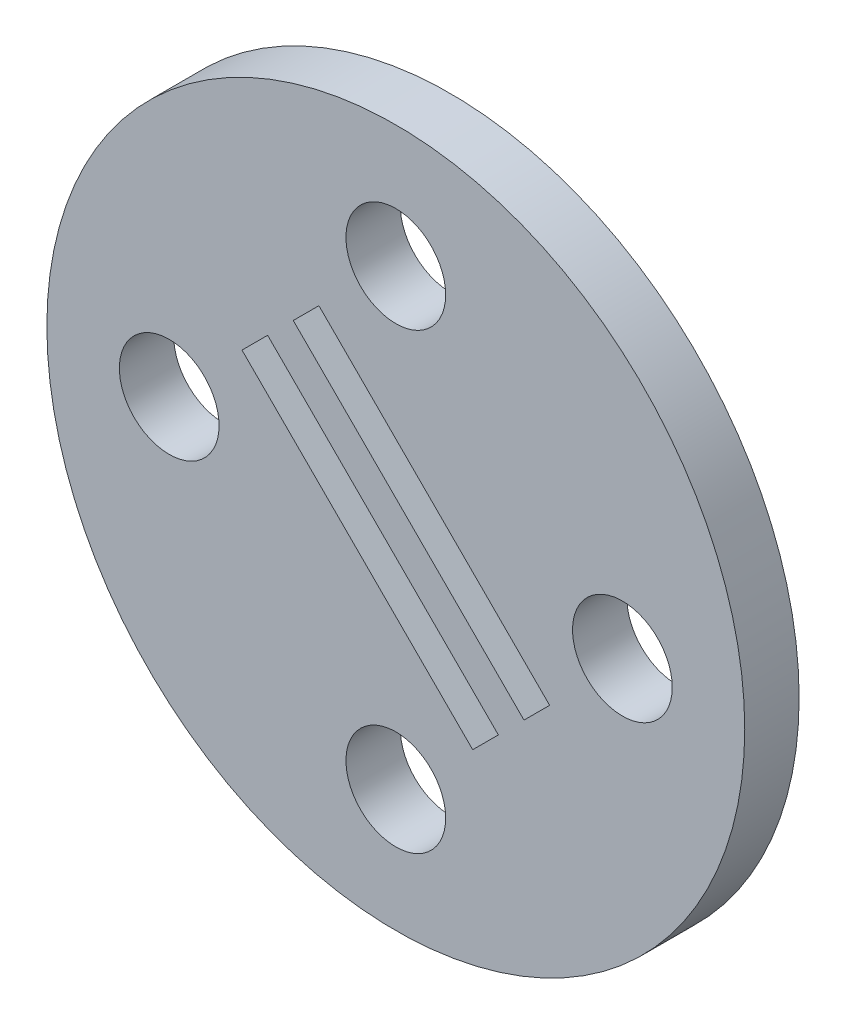
ISO-10303-21;
HEADER;
FILE_DESCRIPTION(('STEP AP214'),'2;1');
FILE_NAME('part.step','',(''),(''),'','','');
FILE_SCHEMA(('AUTOMOTIVE_DESIGN { 1 0 10303 214 1 1 1 1 }'));
ENDSEC;
DATA;
#1=APPLICATION_CONTEXT('core data for automotive mechanical design processes');
#2=APPLICATION_PROTOCOL_DEFINITION('international standard','automotive_design',2000,#1);
#3=PRODUCT_CONTEXT('',#1,'mechanical');
#4=PRODUCT('Part','Part','',(#3));
#5=PRODUCT_RELATED_PRODUCT_CATEGORY('part','',(#4));
#6=PRODUCT_DEFINITION_FORMATION('','',#4);
#7=PRODUCT_DEFINITION_CONTEXT('part definition',#1,'design');
#8=PRODUCT_DEFINITION('design','',#6,#7);
#9=PRODUCT_DEFINITION_SHAPE('','',#8);
#10=(LENGTH_UNIT() NAMED_UNIT(*) SI_UNIT(.MILLI.,.METRE.));
#11=(NAMED_UNIT(*) PLANE_ANGLE_UNIT() SI_UNIT($,.RADIAN.));
#12=(NAMED_UNIT(*) SI_UNIT($,.STERADIAN.) SOLID_ANGLE_UNIT());
#13=UNCERTAINTY_MEASURE_WITH_UNIT(LENGTH_MEASURE(1.E-05),#10,'distance_accuracy_value','');
#14=(GEOMETRIC_REPRESENTATION_CONTEXT(3) GLOBAL_UNCERTAINTY_ASSIGNED_CONTEXT((#13)) GLOBAL_UNIT_ASSIGNED_CONTEXT((#10,
#11,#12)) REPRESENTATION_CONTEXT('',''));
#15=CARTESIAN_POINT('',(0.,0.,0.));
#16=DIRECTION('',(0.,0.,1.));
#17=DIRECTION('',(1.,0.,0.));
#18=AXIS2_PLACEMENT_3D('',#15,#16,#17);
#19=CARTESIAN_POINT('',(0.,0.,6.));
#20=DIRECTION('',(0.,0.,1.));
#21=DIRECTION('',(1.,0.,0.));
#22=AXIS2_PLACEMENT_3D('',#19,#20,#21);
#23=PLANE('',#22);
#24=CARTESIAN_POINT('',(0.,-25.0000000000001,6.));
#25=DIRECTION('',(0.,0.,1.));
#26=DIRECTION('',(1.,0.,0.));
#27=AXIS2_PLACEMENT_3D('',#24,#25,#26);
#28=CIRCLE('',#27,5.50000000000006);
#29=CARTESIAN_POINT('',(5.50000000000006,-25.0000000000001,6.));
#30=VERTEX_POINT('',#29);
#31=EDGE_CURVE('E190',#30,#30,#28,.T.);
#32=ORIENTED_EDGE('',*,*,#31,.F.);
#33=EDGE_LOOP('',(#32));
#34=FACE_BOUND('',#33,.T.);
#35=CARTESIAN_POINT('',(-24.9999999999999,0.,6.));
#36=DIRECTION('',(0.,0.,1.));
#37=DIRECTION('',(1.,0.,0.));
#38=AXIS2_PLACEMENT_3D('',#35,#36,#37);
#39=CIRCLE('',#38,5.50000000000006);
#40=CARTESIAN_POINT('',(-19.4999999999999,0.,6.));
#41=VERTEX_POINT('',#40);
#42=EDGE_CURVE('E126',#41,#41,#39,.T.);
#43=ORIENTED_EDGE('',*,*,#42,.F.);
#44=EDGE_LOOP('',(#43));
#45=FACE_BOUND('',#44,.T.);
#46=DIRECTION('',(0.707106781186546,0.707106781186549,0.));
#47=VECTOR('',#46,1.);
#48=CARTESIAN_POINT('',(11.3137084989848,-14.1421356237309,6.));
#49=LINE('',#48,#47);
#50=CARTESIAN_POINT('',(8.4852813742386,-16.9705627484771,6.));
#51=VERTEX_POINT('',#50);
#52=CARTESIAN_POINT('',(11.3137084989848,-14.1421356237309,6.));
#53=VERTEX_POINT('',#52);
#54=EDGE_CURVE('E138',#51,#53,#49,.T.);
#55=ORIENTED_EDGE('',*,*,#54,.F.);
#56=DIRECTION('',(0.707106781186547,-0.707106781186547,0.));
#57=VECTOR('',#56,1.);
#58=CARTESIAN_POINT('',(8.4852813742386,-16.9705627484771,6.));
#59=LINE('',#58,#57);
#60=CARTESIAN_POINT('',(-16.9705627484771,8.48528137423861,6.));
#61=VERTEX_POINT('',#60);
#62=EDGE_CURVE('E136',#61,#51,#59,.T.);
#63=ORIENTED_EDGE('',*,*,#62,.F.);
#64=DIRECTION('',(-0.707106781186547,-0.707106781186548,0.));
#65=VECTOR('',#64,1.);
#66=CARTESIAN_POINT('',(-16.9705627484771,8.48528137423861,6.));
#67=LINE('',#66,#65);
#68=CARTESIAN_POINT('',(-14.142135623731,11.3137084989847,6.));
#69=VERTEX_POINT('',#68);
#70=EDGE_CURVE('E144',#69,#61,#67,.T.);
#71=ORIENTED_EDGE('',*,*,#70,.F.);
#72=DIRECTION('',(-0.707106781186549,0.707106781186546,0.));
#73=VECTOR('',#72,1.);
#74=CARTESIAN_POINT('',(-14.142135623731,11.3137084989847,6.));
#75=LINE('',#74,#73);
#76=EDGE_CURVE('E141',#53,#69,#75,.T.);
#77=ORIENTED_EDGE('',*,*,#76,.F.);
#78=EDGE_LOOP('',(#55,#63,#71,#77));
#79=FACE_BOUND('',#78,.T.);
#80=CARTESIAN_POINT('',(0.,0.,6.));
#81=DIRECTION('',(0.,0.,1.));
#82=DIRECTION('',(1.,0.,0.));
#83=AXIS2_PLACEMENT_3D('',#80,#81,#82);
#84=CIRCLE('',#83,38.5);
#85=CARTESIAN_POINT('',(38.5,0.,6.));
#86=VERTEX_POINT('',#85);
#87=EDGE_CURVE('E11',#86,#86,#84,.T.);
#88=ORIENTED_EDGE('',*,*,#87,.T.);
#89=EDGE_LOOP('',(#88));
#90=FACE_BOUND('',#89,.T.);
#91=DIRECTION('',(0.707106781186542,-0.707106781186553,0.));
#92=VECTOR('',#91,1.);
#93=CARTESIAN_POINT('',(-11.3137084989845,14.142135623731,6.));
#94=LINE('',#93,#92);
#95=CARTESIAN_POINT('',(-11.3137084989845,14.142135623731,6.));
#96=VERTEX_POINT('',#95);
#97=CARTESIAN_POINT('',(14.142135623731,-11.3137084989848,6.));
#98=VERTEX_POINT('',#97);
#99=EDGE_CURVE('E105',#96,#98,#94,.T.);
#100=ORIENTED_EDGE('',*,*,#99,.F.);
#101=DIRECTION('',(-0.707106781186552,-0.707106781186543,0.));
#102=VECTOR('',#101,1.);
#103=CARTESIAN_POINT('',(-8.48528137423829,16.9705627484772,6.));
#104=LINE('',#103,#102);
#105=CARTESIAN_POINT('',(-8.48528137423829,16.9705627484772,6.));
#106=VERTEX_POINT('',#105);
#107=EDGE_CURVE('E97',#106,#96,#104,.T.);
#108=ORIENTED_EDGE('',*,*,#107,.F.);
#109=DIRECTION('',(-0.707106781186542,0.707106781186553,0.));
#110=VECTOR('',#109,1.);
#111=CARTESIAN_POINT('',(16.9705627484772,-8.48528137423863,6.));
#112=LINE('',#111,#110);
#113=CARTESIAN_POINT('',(16.9705627484772,-8.48528137423863,6.));
#114=VERTEX_POINT('',#113);
#115=EDGE_CURVE('E120',#114,#106,#112,.T.);
#116=ORIENTED_EDGE('',*,*,#115,.F.);
#117=DIRECTION('',(0.707106781186553,0.707106781186542,0.));
#118=VECTOR('',#117,1.);
#119=CARTESIAN_POINT('',(14.142135623731,-11.3137084989848,6.));
#120=LINE('',#119,#118);
#121=EDGE_CURVE('E118',#98,#114,#120,.T.);
#122=ORIENTED_EDGE('',*,*,#121,.F.);
#123=EDGE_LOOP('',(#100,#108,#116,#122));
#124=FACE_BOUND('',#123,.T.);
#125=CARTESIAN_POINT('',(0.,24.9999999999999,6.));
#126=DIRECTION('',(0.,0.,1.));
#127=DIRECTION('',(1.,0.,0.));
#128=AXIS2_PLACEMENT_3D('',#125,#126,#127);
#129=CIRCLE('',#128,5.50000000000006);
#130=CARTESIAN_POINT('',(5.50000000000006,24.9999999999999,6.));
#131=VERTEX_POINT('',#130);
#132=EDGE_CURVE('E195',#131,#131,#129,.T.);
#133=ORIENTED_EDGE('',*,*,#132,.F.);
#134=EDGE_LOOP('',(#133));
#135=FACE_BOUND('',#134,.T.);
#136=CARTESIAN_POINT('',(25.0000000000004,0.,6.));
#137=DIRECTION('',(0.,0.,1.));
#138=DIRECTION('',(1.,0.,0.));
#139=AXIS2_PLACEMENT_3D('',#136,#137,#138);
#140=CIRCLE('',#139,5.50000000000006);
#141=CARTESIAN_POINT('',(30.5000000000004,0.,6.));
#142=VERTEX_POINT('',#141);
#143=EDGE_CURVE('E184',#142,#142,#140,.T.);
#144=ORIENTED_EDGE('',*,*,#143,.F.);
#145=EDGE_LOOP('',(#144));
#146=FACE_BOUND('',#145,.T.);
#147=ADVANCED_FACE('F32',(#34,#45,#79,#90,#124,#135,#146),#23,.T.);
#148=CARTESIAN_POINT('',(0.,0.,0.));
#149=DIRECTION('',(0.,0.,1.));
#150=DIRECTION('',(1.,0.,0.));
#151=AXIS2_PLACEMENT_3D('',#148,#149,#150);
#152=PLANE('',#151);
#153=CARTESIAN_POINT('',(0.,-25.0000000000001,0.));
#154=DIRECTION('',(0.,0.,1.));
#155=DIRECTION('',(1.,0.,0.));
#156=AXIS2_PLACEMENT_3D('',#153,#154,#155);
#157=CIRCLE('',#156,5.50000000000006);
#158=CARTESIAN_POINT('',(5.50000000000006,-25.0000000000001,0.));
#159=VERTEX_POINT('',#158);
#160=EDGE_CURVE('E187',#159,#159,#157,.T.);
#161=ORIENTED_EDGE('',*,*,#160,.T.);
#162=EDGE_LOOP('',(#161));
#163=FACE_BOUND('',#162,.T.);
#164=CARTESIAN_POINT('',(-24.9999999999999,0.,0.));
#165=DIRECTION('',(0.,0.,1.));
#166=DIRECTION('',(1.,0.,0.));
#167=AXIS2_PLACEMENT_3D('',#164,#165,#166);
#168=CIRCLE('',#167,5.50000000000006);
#169=CARTESIAN_POINT('',(-19.4999999999999,0.,0.));
#170=VERTEX_POINT('',#169);
#171=EDGE_CURVE('E198',#170,#170,#168,.T.);
#172=ORIENTED_EDGE('',*,*,#171,.T.);
#173=EDGE_LOOP('',(#172));
#174=FACE_BOUND('',#173,.T.);
#175=DIRECTION('',(0.707106781186547,-0.707106781186547,0.));
#176=VECTOR('',#175,1.);
#177=CARTESIAN_POINT('',(8.4852813742386,-16.9705627484771,0.));
#178=LINE('',#177,#176);
#179=CARTESIAN_POINT('',(-16.9705627484771,8.48528137423861,0.));
#180=VERTEX_POINT('',#179);
#181=CARTESIAN_POINT('',(8.4852813742386,-16.9705627484771,0.));
#182=VERTEX_POINT('',#181);
#183=EDGE_CURVE('E113',#180,#182,#178,.T.);
#184=ORIENTED_EDGE('',*,*,#183,.T.);
#185=DIRECTION('',(0.707106781186546,0.707106781186549,0.));
#186=VECTOR('',#185,1.);
#187=CARTESIAN_POINT('',(11.3137084989848,-14.1421356237309,0.));
#188=LINE('',#187,#186);
#189=CARTESIAN_POINT('',(11.3137084989848,-14.1421356237309,0.));
#190=VERTEX_POINT('',#189);
#191=EDGE_CURVE('E149',#182,#190,#188,.T.);
#192=ORIENTED_EDGE('',*,*,#191,.T.);
#193=DIRECTION('',(-0.707106781186549,0.707106781186546,0.));
#194=VECTOR('',#193,1.);
#195=CARTESIAN_POINT('',(-14.142135623731,11.3137084989847,0.));
#196=LINE('',#195,#194);
#197=CARTESIAN_POINT('',(-14.142135623731,11.3137084989847,0.));
#198=VERTEX_POINT('',#197);
#199=EDGE_CURVE('E152',#190,#198,#196,.T.);
#200=ORIENTED_EDGE('',*,*,#199,.T.);
#201=DIRECTION('',(-0.707106781186547,-0.707106781186548,0.));
#202=VECTOR('',#201,1.);
#203=CARTESIAN_POINT('',(-16.9705627484771,8.48528137423861,0.));
#204=LINE('',#203,#202);
#205=EDGE_CURVE('E139',#198,#180,#204,.T.);
#206=ORIENTED_EDGE('',*,*,#205,.T.);
#207=EDGE_LOOP('',(#184,#192,#200,#206));
#208=FACE_BOUND('',#207,.T.);
#209=CARTESIAN_POINT('',(0.,0.,0.));
#210=DIRECTION('',(0.,0.,1.));
#211=DIRECTION('',(1.,0.,0.));
#212=AXIS2_PLACEMENT_3D('',#209,#210,#211);
#213=CIRCLE('',#212,38.5);
#214=CARTESIAN_POINT('',(38.5,0.,0.));
#215=VERTEX_POINT('',#214);
#216=EDGE_CURVE('E36',#215,#215,#213,.T.);
#217=ORIENTED_EDGE('',*,*,#216,.F.);
#218=EDGE_LOOP('',(#217));
#219=FACE_BOUND('',#218,.T.);
#220=DIRECTION('',(-0.707106781186552,-0.707106781186543,0.));
#221=VECTOR('',#220,1.);
#222=CARTESIAN_POINT('',(-8.48528137423829,16.9705627484772,0.));
#223=LINE('',#222,#221);
#224=CARTESIAN_POINT('',(-8.48528137423829,16.9705627484772,0.));
#225=VERTEX_POINT('',#224);
#226=CARTESIAN_POINT('',(-11.3137084989845,14.142135623731,0.));
#227=VERTEX_POINT('',#226);
#228=EDGE_CURVE('E55',#225,#227,#223,.T.);
#229=ORIENTED_EDGE('',*,*,#228,.T.);
#230=DIRECTION('',(0.707106781186542,-0.707106781186553,0.));
#231=VECTOR('',#230,1.);
#232=CARTESIAN_POINT('',(-11.3137084989845,14.142135623731,0.));
#233=LINE('',#232,#231);
#234=CARTESIAN_POINT('',(14.142135623731,-11.3137084989848,0.));
#235=VERTEX_POINT('',#234);
#236=EDGE_CURVE('E112',#227,#235,#233,.T.);
#237=ORIENTED_EDGE('',*,*,#236,.T.);
#238=DIRECTION('',(0.707106781186553,0.707106781186542,0.));
#239=VECTOR('',#238,1.);
#240=CARTESIAN_POINT('',(14.142135623731,-11.3137084989848,0.));
#241=LINE('',#240,#239);
#242=CARTESIAN_POINT('',(16.9705627484772,-8.48528137423863,0.));
#243=VERTEX_POINT('',#242);
#244=EDGE_CURVE('E128',#235,#243,#241,.T.);
#245=ORIENTED_EDGE('',*,*,#244,.T.);
#246=DIRECTION('',(-0.707106781186542,0.707106781186553,0.));
#247=VECTOR('',#246,1.);
#248=CARTESIAN_POINT('',(16.9705627484772,-8.48528137423863,0.));
#249=LINE('',#248,#247);
#250=EDGE_CURVE('E106',#243,#225,#249,.T.);
#251=ORIENTED_EDGE('',*,*,#250,.T.);
#252=EDGE_LOOP('',(#229,#237,#245,#251));
#253=FACE_BOUND('',#252,.T.);
#254=CARTESIAN_POINT('',(0.,24.9999999999999,0.));
#255=DIRECTION('',(0.,0.,1.));
#256=DIRECTION('',(1.,0.,0.));
#257=AXIS2_PLACEMENT_3D('',#254,#255,#256);
#258=CIRCLE('',#257,5.50000000000006);
#259=CARTESIAN_POINT('',(5.50000000000006,24.9999999999999,0.));
#260=VERTEX_POINT('',#259);
#261=EDGE_CURVE('E179',#260,#260,#258,.T.);
#262=ORIENTED_EDGE('',*,*,#261,.T.);
#263=EDGE_LOOP('',(#262));
#264=FACE_BOUND('',#263,.T.);
#265=CARTESIAN_POINT('',(25.0000000000004,0.,0.));
#266=DIRECTION('',(0.,0.,1.));
#267=DIRECTION('',(1.,0.,0.));
#268=AXIS2_PLACEMENT_3D('',#265,#266,#267);
#269=CIRCLE('',#268,5.50000000000006);
#270=CARTESIAN_POINT('',(30.5000000000004,0.,0.));
#271=VERTEX_POINT('',#270);
#272=EDGE_CURVE('E182',#271,#271,#269,.T.);
#273=ORIENTED_EDGE('',*,*,#272,.T.);
#274=EDGE_LOOP('',(#273));
#275=FACE_BOUND('',#274,.T.);
#276=ADVANCED_FACE('F171',(#163,#174,#208,#219,#253,#264,#275),#152,.F.);
#277=CARTESIAN_POINT('',(0.,0.,6.));
#278=DIRECTION('',(0.,0.,-1.));
#279=DIRECTION('',(-1.,0.,0.));
#280=AXIS2_PLACEMENT_3D('',#277,#278,#279);
#281=CYLINDRICAL_SURFACE('',#280,38.5);
#282=ORIENTED_EDGE('',*,*,#87,.F.);
#283=EDGE_LOOP('',(#282));
#284=FACE_BOUND('',#283,.T.);
#285=ORIENTED_EDGE('',*,*,#216,.T.);
#286=EDGE_LOOP('',(#285));
#287=FACE_BOUND('',#286,.T.);
#288=ADVANCED_FACE('F34',(#284,#287),#281,.T.);
#289=CARTESIAN_POINT('',(8.4852813742386,-16.9705627484771,6.));
#290=DIRECTION('',(0.707106781186548,0.707106781186548,0.));
#291=DIRECTION('',(-0.707106781186548,0.707106781186548,0.));
#292=AXIS2_PLACEMENT_3D('',#289,#290,#291);
#293=PLANE('',#292);
#294=ORIENTED_EDGE('',*,*,#183,.F.);
#295=DIRECTION('',(0.,0.,-1.));
#296=VECTOR('',#295,1.);
#297=CARTESIAN_POINT('',(-16.9705627484771,8.48528137423861,6.));
#298=LINE('',#297,#296);
#299=EDGE_CURVE('E146',#61,#180,#298,.T.);
#300=ORIENTED_EDGE('',*,*,#299,.F.);
#301=ORIENTED_EDGE('',*,*,#62,.T.);
#302=DIRECTION('',(0.,0.,-1.));
#303=VECTOR('',#302,1.);
#304=CARTESIAN_POINT('',(8.4852813742386,-16.9705627484771,6.));
#305=LINE('',#304,#303);
#306=EDGE_CURVE('E163',#51,#182,#305,.T.);
#307=ORIENTED_EDGE('',*,*,#306,.T.);
#308=EDGE_LOOP('',(#294,#300,#301,#307));
#309=FACE_BOUND('',#308,.T.);
#310=ADVANCED_FACE('F229',(#309),#293,.T.);
#311=CARTESIAN_POINT('',(11.3137084989848,-14.1421356237309,6.));
#312=DIRECTION('',(-0.707106781186549,0.707106781186546,0.));
#313=DIRECTION('',(-0.707106781186546,-0.707106781186549,0.));
#314=AXIS2_PLACEMENT_3D('',#311,#312,#313);
#315=PLANE('',#314);
#316=ORIENTED_EDGE('',*,*,#191,.F.);
#317=ORIENTED_EDGE('',*,*,#306,.F.);
#318=ORIENTED_EDGE('',*,*,#54,.T.);
#319=DIRECTION('',(0.,0.,-1.));
#320=VECTOR('',#319,1.);
#321=CARTESIAN_POINT('',(11.3137084989848,-14.1421356237309,6.));
#322=LINE('',#321,#320);
#323=EDGE_CURVE('E161',#53,#190,#322,.T.);
#324=ORIENTED_EDGE('',*,*,#323,.T.);
#325=EDGE_LOOP('',(#316,#317,#318,#324));
#326=FACE_BOUND('',#325,.T.);
#327=ADVANCED_FACE('F232',(#326),#315,.T.);
#328=CARTESIAN_POINT('',(-14.142135623731,11.3137084989847,6.));
#329=DIRECTION('',(-0.707106781186546,-0.707106781186549,0.));
#330=DIRECTION('',(0.707106781186549,-0.707106781186546,0.));
#331=AXIS2_PLACEMENT_3D('',#328,#329,#330);
#332=PLANE('',#331);
#333=ORIENTED_EDGE('',*,*,#199,.F.);
#334=ORIENTED_EDGE('',*,*,#323,.F.);
#335=ORIENTED_EDGE('',*,*,#76,.T.);
#336=DIRECTION('',(0.,0.,-1.));
#337=VECTOR('',#336,1.);
#338=CARTESIAN_POINT('',(-14.142135623731,11.3137084989847,6.));
#339=LINE('',#338,#337);
#340=EDGE_CURVE('E159',#69,#198,#339,.T.);
#341=ORIENTED_EDGE('',*,*,#340,.T.);
#342=EDGE_LOOP('',(#333,#334,#335,#341));
#343=FACE_BOUND('',#342,.T.);
#344=ADVANCED_FACE('F235',(#343),#332,.T.);
#345=CARTESIAN_POINT('',(-16.9705627484771,8.48528137423861,6.));
#346=DIRECTION('',(0.707106781186548,-0.707106781186547,0.));
#347=DIRECTION('',(0.707106781186547,0.707106781186548,0.));
#348=AXIS2_PLACEMENT_3D('',#345,#346,#347);
#349=PLANE('',#348);
#350=ORIENTED_EDGE('',*,*,#205,.F.);
#351=ORIENTED_EDGE('',*,*,#340,.F.);
#352=ORIENTED_EDGE('',*,*,#70,.T.);
#353=ORIENTED_EDGE('',*,*,#299,.T.);
#354=EDGE_LOOP('',(#350,#351,#352,#353));
#355=FACE_BOUND('',#354,.T.);
#356=ADVANCED_FACE('F239',(#355),#349,.T.);
#357=CARTESIAN_POINT('',(-8.48528137423829,16.9705627484772,6.));
#358=DIRECTION('',(0.707106781186543,-0.707106781186552,0.));
#359=DIRECTION('',(0.707106781186552,0.707106781186543,0.));
#360=AXIS2_PLACEMENT_3D('',#357,#358,#359);
#361=PLANE('',#360);
#362=ORIENTED_EDGE('',*,*,#228,.F.);
#363=DIRECTION('',(0.,0.,-1.));
#364=VECTOR('',#363,1.);
#365=CARTESIAN_POINT('',(-8.48528137423829,16.9705627484772,6.));
#366=LINE('',#365,#364);
#367=EDGE_CURVE('E101',#106,#225,#366,.T.);
#368=ORIENTED_EDGE('',*,*,#367,.F.);
#369=ORIENTED_EDGE('',*,*,#107,.T.);
#370=DIRECTION('',(0.,0.,-1.));
#371=VECTOR('',#370,1.);
#372=CARTESIAN_POINT('',(-11.3137084989845,14.142135623731,6.));
#373=LINE('',#372,#371);
#374=EDGE_CURVE('E100',#96,#227,#373,.T.);
#375=ORIENTED_EDGE('',*,*,#374,.T.);
#376=EDGE_LOOP('',(#362,#368,#369,#375));
#377=FACE_BOUND('',#376,.T.);
#378=ADVANCED_FACE('F99',(#377),#361,.T.);
#379=CARTESIAN_POINT('',(-11.3137084989845,14.142135623731,6.));
#380=DIRECTION('',(0.707106781186553,0.707106781186542,0.));
#381=DIRECTION('',(-0.707106781186542,0.707106781186553,0.));
#382=AXIS2_PLACEMENT_3D('',#379,#380,#381);
#383=PLANE('',#382);
#384=ORIENTED_EDGE('',*,*,#236,.F.);
#385=ORIENTED_EDGE('',*,*,#374,.F.);
#386=ORIENTED_EDGE('',*,*,#99,.T.);
#387=DIRECTION('',(0.,0.,-1.));
#388=VECTOR('',#387,1.);
#389=CARTESIAN_POINT('',(14.142135623731,-11.3137084989848,6.));
#390=LINE('',#389,#388);
#391=EDGE_CURVE('E114',#98,#235,#390,.T.);
#392=ORIENTED_EDGE('',*,*,#391,.T.);
#393=EDGE_LOOP('',(#384,#385,#386,#392));
#394=FACE_BOUND('',#393,.T.);
#395=ADVANCED_FACE('F109',(#394),#383,.T.);
#396=CARTESIAN_POINT('',(14.142135623731,-11.3137084989848,6.));
#397=DIRECTION('',(-0.707106781186542,0.707106781186553,0.));
#398=DIRECTION('',(-0.707106781186553,-0.707106781186542,0.));
#399=AXIS2_PLACEMENT_3D('',#396,#397,#398);
#400=PLANE('',#399);
#401=ORIENTED_EDGE('',*,*,#244,.F.);
#402=ORIENTED_EDGE('',*,*,#391,.F.);
#403=ORIENTED_EDGE('',*,*,#121,.T.);
#404=DIRECTION('',(0.,0.,-1.));
#405=VECTOR('',#404,1.);
#406=CARTESIAN_POINT('',(16.9705627484772,-8.48528137423863,6.));
#407=LINE('',#406,#405);
#408=EDGE_CURVE('E47',#114,#243,#407,.T.);
#409=ORIENTED_EDGE('',*,*,#408,.T.);
#410=EDGE_LOOP('',(#401,#402,#403,#409));
#411=FACE_BOUND('',#410,.T.);
#412=ADVANCED_FACE('F219',(#411),#400,.T.);
#413=CARTESIAN_POINT('',(16.9705627484772,-8.48528137423863,6.));
#414=DIRECTION('',(-0.707106781186553,-0.707106781186542,0.));
#415=DIRECTION('',(0.707106781186542,-0.707106781186553,0.));
#416=AXIS2_PLACEMENT_3D('',#413,#414,#415);
#417=PLANE('',#416);
#418=ORIENTED_EDGE('',*,*,#250,.F.);
#419=ORIENTED_EDGE('',*,*,#408,.F.);
#420=ORIENTED_EDGE('',*,*,#115,.T.);
#421=ORIENTED_EDGE('',*,*,#367,.T.);
#422=EDGE_LOOP('',(#418,#419,#420,#421));
#423=FACE_BOUND('',#422,.T.);
#424=ADVANCED_FACE('F209',(#423),#417,.T.);
#425=CARTESIAN_POINT('',(-24.9999999999999,0.,6.));
#426=DIRECTION('',(0.,0.,-1.));
#427=DIRECTION('',(-1.,0.,0.));
#428=AXIS2_PLACEMENT_3D('',#425,#426,#427);
#429=CYLINDRICAL_SURFACE('',#428,5.50000000000006);
#430=ORIENTED_EDGE('',*,*,#42,.T.);
#431=EDGE_LOOP('',(#430));
#432=FACE_BOUND('',#431,.T.);
#433=ORIENTED_EDGE('',*,*,#171,.F.);
#434=EDGE_LOOP('',(#433));
#435=FACE_BOUND('',#434,.T.);
#436=ADVANCED_FACE('F206',(#432,#435),#429,.F.);
#437=CARTESIAN_POINT('',(0.,24.9999999999999,6.));
#438=DIRECTION('',(0.,0.,-1.));
#439=DIRECTION('',(-1.,0.,0.));
#440=AXIS2_PLACEMENT_3D('',#437,#438,#439);
#441=CYLINDRICAL_SURFACE('',#440,5.50000000000006);
#442=ORIENTED_EDGE('',*,*,#132,.T.);
#443=EDGE_LOOP('',(#442));
#444=FACE_BOUND('',#443,.T.);
#445=ORIENTED_EDGE('',*,*,#261,.F.);
#446=EDGE_LOOP('',(#445));
#447=FACE_BOUND('',#446,.T.);
#448=ADVANCED_FACE('F208',(#444,#447),#441,.F.);
#449=CARTESIAN_POINT('',(0.,-25.0000000000001,6.));
#450=DIRECTION('',(0.,0.,-1.));
#451=DIRECTION('',(-1.,0.,0.));
#452=AXIS2_PLACEMENT_3D('',#449,#450,#451);
#453=CYLINDRICAL_SURFACE('',#452,5.50000000000006);
#454=ORIENTED_EDGE('',*,*,#31,.T.);
#455=EDGE_LOOP('',(#454));
#456=FACE_BOUND('',#455,.T.);
#457=ORIENTED_EDGE('',*,*,#160,.F.);
#458=EDGE_LOOP('',(#457));
#459=FACE_BOUND('',#458,.T.);
#460=ADVANCED_FACE('F216',(#456,#459),#453,.F.);
#461=CARTESIAN_POINT('',(25.0000000000004,0.,6.));
#462=DIRECTION('',(0.,0.,-1.));
#463=DIRECTION('',(-1.,0.,0.));
#464=AXIS2_PLACEMENT_3D('',#461,#462,#463);
#465=CYLINDRICAL_SURFACE('',#464,5.50000000000006);
#466=ORIENTED_EDGE('',*,*,#143,.T.);
#467=EDGE_LOOP('',(#466));
#468=FACE_BOUND('',#467,.T.);
#469=ORIENTED_EDGE('',*,*,#272,.F.);
#470=EDGE_LOOP('',(#469));
#471=FACE_BOUND('',#470,.T.);
#472=ADVANCED_FACE('F278',(#468,#471),#465,.F.);
#473=CLOSED_SHELL('',(#147,#276,#288,#310,#327,#344,#356,#378,#395,#412,#424,#436,#448,#460,#472));
#474=MANIFOLD_SOLID_BREP('B2',#473);
#475=ADVANCED_BREP_SHAPE_REPRESENTATION('',(#18,#474),#14);
#476=SHAPE_DEFINITION_REPRESENTATION(#9,#475);
ENDSEC;
END-ISO-10303-21;
